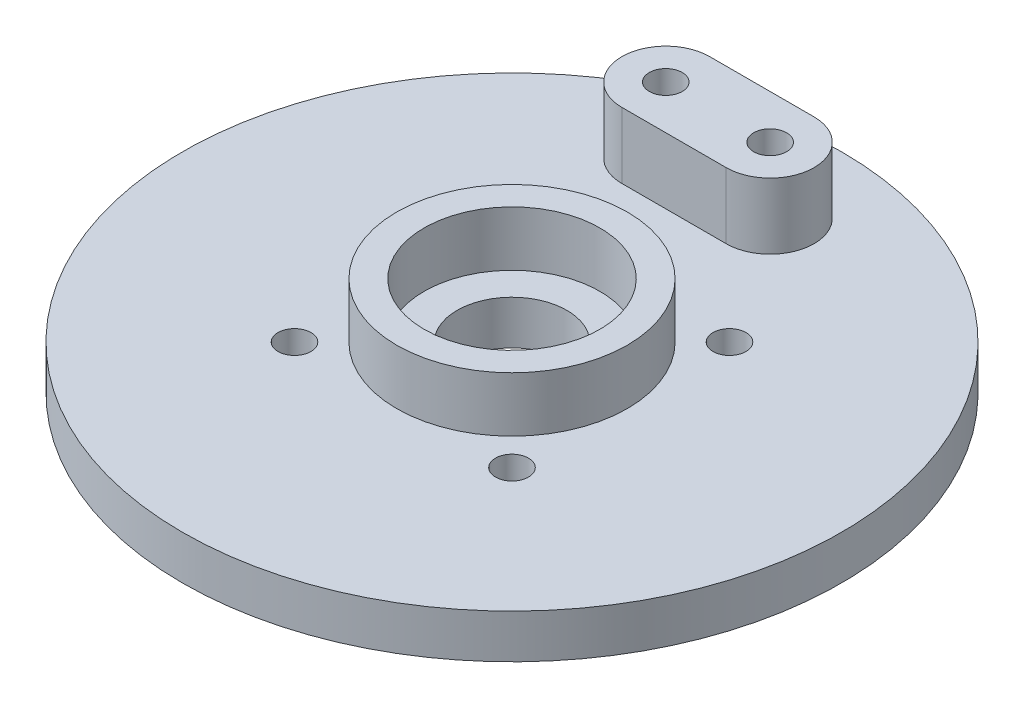
ISO-10303-21;
HEADER;
FILE_DESCRIPTION(('STEP AP214'),'2;1');
FILE_NAME('part.step','',(''),(''),'','','');
FILE_SCHEMA(('AUTOMOTIVE_DESIGN { 1 0 10303 214 1 1 1 1 }'));
ENDSEC;
DATA;
#1=APPLICATION_CONTEXT('core data for automotive mechanical design processes');
#2=APPLICATION_PROTOCOL_DEFINITION('international standard','automotive_design',2000,#1);
#3=PRODUCT_CONTEXT('',#1,'mechanical');
#4=PRODUCT('Part','Part','',(#3));
#5=PRODUCT_RELATED_PRODUCT_CATEGORY('part','',(#4));
#6=PRODUCT_DEFINITION_FORMATION('','',#4);
#7=PRODUCT_DEFINITION_CONTEXT('part definition',#1,'design');
#8=PRODUCT_DEFINITION('design','',#6,#7);
#9=PRODUCT_DEFINITION_SHAPE('','',#8);
#10=(LENGTH_UNIT() NAMED_UNIT(*) SI_UNIT(.MILLI.,.METRE.));
#11=(NAMED_UNIT(*) PLANE_ANGLE_UNIT() SI_UNIT($,.RADIAN.));
#12=(NAMED_UNIT(*) SI_UNIT($,.STERADIAN.) SOLID_ANGLE_UNIT());
#13=UNCERTAINTY_MEASURE_WITH_UNIT(LENGTH_MEASURE(1.E-05),#10,'distance_accuracy_value','');
#14=(GEOMETRIC_REPRESENTATION_CONTEXT(3) GLOBAL_UNCERTAINTY_ASSIGNED_CONTEXT((#13)) GLOBAL_UNIT_ASSIGNED_CONTEXT((#10,
#11,#12)) REPRESENTATION_CONTEXT('',''));
#15=CARTESIAN_POINT('',(0.,0.,0.));
#16=DIRECTION('',(0.,0.,1.));
#17=DIRECTION('',(1.,0.,0.));
#18=AXIS2_PLACEMENT_3D('',#15,#16,#17);
#19=CARTESIAN_POINT('',(0.,4.,0.));
#20=DIRECTION('',(0.,1.,0.));
#21=DIRECTION('',(0.,0.,1.));
#22=AXIS2_PLACEMENT_3D('',#19,#20,#21);
#23=PLANE('',#22);
#24=CARTESIAN_POINT('',(-9.89949493661168,4.,9.89949493661165));
#25=DIRECTION('',(0.,1.,0.));
#26=DIRECTION('',(0.,0.,1.));
#27=AXIS2_PLACEMENT_3D('',#24,#25,#26);
#28=CIRCLE('',#27,1.5);
#29=CARTESIAN_POINT('',(-9.89949493661168,4.,11.3994949366116));
#30=VERTEX_POINT('',#29);
#31=EDGE_CURVE('E169',#30,#30,#28,.T.);
#32=ORIENTED_EDGE('',*,*,#31,.F.);
#33=EDGE_LOOP('',(#32));
#34=FACE_BOUND('',#33,.T.);
#35=CARTESIAN_POINT('',(9.89949493661165,4.,9.89949493661168));
#36=DIRECTION('',(0.,1.,0.));
#37=DIRECTION('',(0.,0.,1.));
#38=AXIS2_PLACEMENT_3D('',#35,#36,#37);
#39=CIRCLE('',#38,1.5);
#40=CARTESIAN_POINT('',(9.89949493661165,4.,11.3994949366117));
#41=VERTEX_POINT('',#40);
#42=EDGE_CURVE('E173',#41,#41,#39,.T.);
#43=ORIENTED_EDGE('',*,*,#42,.F.);
#44=EDGE_LOOP('',(#43));
#45=FACE_BOUND('',#44,.T.);
#46=CARTESIAN_POINT('',(9.89949493661168,4.,-9.89949493661165));
#47=DIRECTION('',(0.,1.,0.));
#48=DIRECTION('',(0.,0.,1.));
#49=AXIS2_PLACEMENT_3D('',#46,#47,#48);
#50=CIRCLE('',#49,1.5);
#51=CARTESIAN_POINT('',(9.89949493661168,4.,-8.39949493661165));
#52=VERTEX_POINT('',#51);
#53=EDGE_CURVE('E177',#52,#52,#50,.T.);
#54=ORIENTED_EDGE('',*,*,#53,.F.);
#55=EDGE_LOOP('',(#54));
#56=FACE_BOUND('',#55,.T.);
#57=CARTESIAN_POINT('',(-9.89949493661165,4.,-9.89949493661168));
#58=DIRECTION('',(0.,1.,0.));
#59=DIRECTION('',(0.,0.,1.));
#60=AXIS2_PLACEMENT_3D('',#57,#58,#59);
#61=CIRCLE('',#60,1.5);
#62=CARTESIAN_POINT('',(-9.89949493661165,4.,-8.39949493661168));
#63=VERTEX_POINT('',#62);
#64=EDGE_CURVE('E181',#63,#63,#61,.T.);
#65=ORIENTED_EDGE('',*,*,#64,.F.);
#66=EDGE_LOOP('',(#65));
#67=FACE_BOUND('',#66,.T.);
#68=CARTESIAN_POINT('',(0.,4.,0.));
#69=DIRECTION('',(0.,1.,0.));
#70=DIRECTION('',(0.,0.,1.));
#71=AXIS2_PLACEMENT_3D('',#68,#69,#70);
#72=CIRCLE('',#71,30.);
#73=CARTESIAN_POINT('',(0.,4.,30.));
#74=VERTEX_POINT('',#73);
#75=EDGE_CURVE('E40',#74,#74,#72,.T.);
#76=ORIENTED_EDGE('',*,*,#75,.T.);
#77=EDGE_LOOP('',(#76));
#78=FACE_BOUND('',#77,.T.);
#79=CARTESIAN_POINT('',(0.,4.,0.));
#80=DIRECTION('',(0.,1.,0.));
#81=DIRECTION('',(0.,0.,1.));
#82=AXIS2_PLACEMENT_3D('',#79,#80,#81);
#83=CIRCLE('',#82,10.5);
#84=CARTESIAN_POINT('',(0.,4.,10.5));
#85=VERTEX_POINT('',#84);
#86=EDGE_CURVE('E120',#85,#85,#83,.T.);
#87=ORIENTED_EDGE('',*,*,#86,.F.);
#88=EDGE_LOOP('',(#87));
#89=FACE_BOUND('',#88,.T.);
#90=DIRECTION('',(-1.,0.,0.));
#91=VECTOR('',#90,1.);
#92=CARTESIAN_POINT('',(2.,4.,-25.5));
#93=LINE('',#92,#91);
#94=CARTESIAN_POINT('',(2.,4.,-25.5));
#95=VERTEX_POINT('',#94);
#96=CARTESIAN_POINT('',(-7.5,4.,-25.5));
#97=VERTEX_POINT('',#96);
#98=EDGE_CURVE('E89',#95,#97,#93,.T.);
#99=ORIENTED_EDGE('',*,*,#98,.F.);
#100=CARTESIAN_POINT('',(2.,4.,-21.5));
#101=DIRECTION('',(0.,1.,0.));
#102=DIRECTION('',(0.,0.,1.));
#103=AXIS2_PLACEMENT_3D('',#100,#101,#102);
#104=CIRCLE('',#103,4.);
#105=CARTESIAN_POINT('',(2.,4.,-17.5));
#106=VERTEX_POINT('',#105);
#107=EDGE_CURVE('E100',#106,#95,#104,.T.);
#108=ORIENTED_EDGE('',*,*,#107,.F.);
#109=DIRECTION('',(1.,0.,0.));
#110=VECTOR('',#109,1.);
#111=CARTESIAN_POINT('',(-7.5,4.,-17.5));
#112=LINE('',#111,#110);
#113=CARTESIAN_POINT('',(-7.5,4.,-17.5));
#114=VERTEX_POINT('',#113);
#115=EDGE_CURVE('E69',#114,#106,#112,.T.);
#116=ORIENTED_EDGE('',*,*,#115,.F.);
#117=CARTESIAN_POINT('',(-7.5,4.,-21.5));
#118=DIRECTION('',(0.,1.,0.));
#119=DIRECTION('',(0.,0.,1.));
#120=AXIS2_PLACEMENT_3D('',#117,#118,#119);
#121=CIRCLE('',#120,4.);
#122=EDGE_CURVE('E105',#97,#114,#121,.T.);
#123=ORIENTED_EDGE('',*,*,#122,.F.);
#124=EDGE_LOOP('',(#99,#108,#116,#123));
#125=FACE_BOUND('',#124,.T.);
#126=ADVANCED_FACE('F32',(#34,#45,#56,#67,#78,#89,#125),#23,.T.);
#127=CARTESIAN_POINT('',(0.,4.,0.));
#128=DIRECTION('',(0.,1.,0.));
#129=DIRECTION('',(0.,0.,1.));
#130=AXIS2_PLACEMENT_3D('',#127,#128,#129);
#131=CIRCLE('',#130,5.);
#132=CARTESIAN_POINT('',(0.,4.,5.));
#133=VERTEX_POINT('',#132);
#134=EDGE_CURVE('E127',#133,#133,#131,.T.);
#135=ORIENTED_EDGE('',*,*,#134,.F.);
#136=EDGE_LOOP('',(#135));
#137=FACE_BOUND('',#136,.T.);
#138=CARTESIAN_POINT('',(0.,4.,0.));
#139=DIRECTION('',(0.,1.,0.));
#140=DIRECTION('',(0.,0.,1.));
#141=AXIS2_PLACEMENT_3D('',#138,#139,#140);
#142=CIRCLE('',#141,8.);
#143=CARTESIAN_POINT('',(0.,4.,8.));
#144=VERTEX_POINT('',#143);
#145=EDGE_CURVE('E11',#144,#144,#142,.F.);
#146=ORIENTED_EDGE('',*,*,#145,.F.);
#147=EDGE_LOOP('',(#146));
#148=FACE_BOUND('',#147,.T.);
#149=ADVANCED_FACE('F141',(#137,#148),#23,.T.);
#150=CARTESIAN_POINT('',(0.,0.,0.));
#151=DIRECTION('',(0.,1.,0.));
#152=DIRECTION('',(0.,0.,1.));
#153=AXIS2_PLACEMENT_3D('',#150,#151,#152);
#154=PLANE('',#153);
#155=CARTESIAN_POINT('',(-9.89949493661168,0.,9.89949493661165));
#156=DIRECTION('',(0.,1.,0.));
#157=DIRECTION('',(0.,0.,1.));
#158=AXIS2_PLACEMENT_3D('',#155,#156,#157);
#159=CIRCLE('',#158,1.5);
#160=CARTESIAN_POINT('',(-9.89949493661168,0.,11.3994949366116));
#161=VERTEX_POINT('',#160);
#162=EDGE_CURVE('E319',#161,#161,#159,.T.);
#163=ORIENTED_EDGE('',*,*,#162,.T.);
#164=EDGE_LOOP('',(#163));
#165=FACE_BOUND('',#164,.T.);
#166=CARTESIAN_POINT('',(9.89949493661165,0.,9.89949493661168));
#167=DIRECTION('',(0.,1.,0.));
#168=DIRECTION('',(0.,0.,1.));
#169=AXIS2_PLACEMENT_3D('',#166,#167,#168);
#170=CIRCLE('',#169,1.5);
#171=CARTESIAN_POINT('',(9.89949493661165,0.,11.3994949366117));
#172=VERTEX_POINT('',#171);
#173=EDGE_CURVE('E342',#172,#172,#170,.T.);
#174=ORIENTED_EDGE('',*,*,#173,.T.);
#175=EDGE_LOOP('',(#174));
#176=FACE_BOUND('',#175,.T.);
#177=CARTESIAN_POINT('',(9.89949493661168,0.,-9.89949493661165));
#178=DIRECTION('',(0.,1.,0.));
#179=DIRECTION('',(0.,0.,1.));
#180=AXIS2_PLACEMENT_3D('',#177,#178,#179);
#181=CIRCLE('',#180,1.5);
#182=CARTESIAN_POINT('',(9.89949493661168,0.,-8.39949493661165));
#183=VERTEX_POINT('',#182);
#184=EDGE_CURVE('E329',#183,#183,#181,.T.);
#185=ORIENTED_EDGE('',*,*,#184,.T.);
#186=EDGE_LOOP('',(#185));
#187=FACE_BOUND('',#186,.T.);
#188=CARTESIAN_POINT('',(-9.89949493661165,0.,-9.89949493661168));
#189=DIRECTION('',(0.,1.,0.));
#190=DIRECTION('',(0.,0.,1.));
#191=AXIS2_PLACEMENT_3D('',#188,#189,#190);
#192=CIRCLE('',#191,1.5);
#193=CARTESIAN_POINT('',(-9.89949493661165,0.,-8.39949493661168));
#194=VERTEX_POINT('',#193);
#195=EDGE_CURVE('E324',#194,#194,#192,.T.);
#196=ORIENTED_EDGE('',*,*,#195,.T.);
#197=EDGE_LOOP('',(#196));
#198=FACE_BOUND('',#197,.T.);
#199=CARTESIAN_POINT('',(-7.5,0.,-21.5));
#200=DIRECTION('',(0.,1.,0.));
#201=DIRECTION('',(0.,0.,1.));
#202=AXIS2_PLACEMENT_3D('',#199,#200,#201);
#203=CIRCLE('',#202,1.5);
#204=CARTESIAN_POINT('',(-7.5,0.,-20.));
#205=VERTEX_POINT('',#204);
#206=EDGE_CURVE('E112',#205,#205,#203,.T.);
#207=ORIENTED_EDGE('',*,*,#206,.T.);
#208=EDGE_LOOP('',(#207));
#209=FACE_BOUND('',#208,.T.);
#210=CARTESIAN_POINT('',(2.,0.,-21.5));
#211=DIRECTION('',(0.,1.,0.));
#212=DIRECTION('',(0.,0.,1.));
#213=AXIS2_PLACEMENT_3D('',#210,#211,#212);
#214=CIRCLE('',#213,1.5);
#215=CARTESIAN_POINT('',(2.,0.,-20.));
#216=VERTEX_POINT('',#215);
#217=EDGE_CURVE('E111',#216,#216,#214,.T.);
#218=ORIENTED_EDGE('',*,*,#217,.T.);
#219=EDGE_LOOP('',(#218));
#220=FACE_BOUND('',#219,.T.);
#221=CARTESIAN_POINT('',(0.,0.,0.));
#222=DIRECTION('',(0.,1.,0.));
#223=DIRECTION('',(0.,0.,1.));
#224=AXIS2_PLACEMENT_3D('',#221,#222,#223);
#225=CIRCLE('',#224,30.);
#226=CARTESIAN_POINT('',(0.,0.,30.));
#227=VERTEX_POINT('',#226);
#228=EDGE_CURVE('E130',#227,#227,#225,.T.);
#229=ORIENTED_EDGE('',*,*,#228,.F.);
#230=EDGE_LOOP('',(#229));
#231=FACE_BOUND('',#230,.T.);
#232=CARTESIAN_POINT('',(0.,0.,0.));
#233=DIRECTION('',(0.,1.,0.));
#234=DIRECTION('',(0.,0.,1.));
#235=AXIS2_PLACEMENT_3D('',#232,#233,#234);
#236=CIRCLE('',#235,5.);
#237=CARTESIAN_POINT('',(0.,0.,5.));
#238=VERTEX_POINT('',#237);
#239=EDGE_CURVE('E124',#238,#238,#236,.T.);
#240=ORIENTED_EDGE('',*,*,#239,.T.);
#241=EDGE_LOOP('',(#240));
#242=FACE_BOUND('',#241,.T.);
#243=ADVANCED_FACE('F138',(#165,#176,#187,#198,#209,#220,#231,#242),#154,.F.);
#244=CARTESIAN_POINT('',(0.,4.,0.));
#245=DIRECTION('',(0.,-1.,0.));
#246=DIRECTION('',(0.,0.,-1.));
#247=AXIS2_PLACEMENT_3D('',#244,#245,#246);
#248=CYLINDRICAL_SURFACE('',#247,30.);
#249=ORIENTED_EDGE('',*,*,#75,.F.);
#250=EDGE_LOOP('',(#249));
#251=FACE_BOUND('',#250,.T.);
#252=ORIENTED_EDGE('',*,*,#228,.T.);
#253=EDGE_LOOP('',(#252));
#254=FACE_BOUND('',#253,.T.);
#255=ADVANCED_FACE('F34',(#251,#254),#248,.T.);
#256=CARTESIAN_POINT('',(0.,4.,0.));
#257=DIRECTION('',(0.,-1.,0.));
#258=DIRECTION('',(0.,0.,-1.));
#259=AXIS2_PLACEMENT_3D('',#256,#257,#258);
#260=CYLINDRICAL_SURFACE('',#259,5.);
#261=ORIENTED_EDGE('',*,*,#134,.T.);
#262=EDGE_LOOP('',(#261));
#263=FACE_BOUND('',#262,.T.);
#264=ORIENTED_EDGE('',*,*,#239,.F.);
#265=EDGE_LOOP('',(#264));
#266=FACE_BOUND('',#265,.T.);
#267=ADVANCED_FACE('F145',(#263,#266),#260,.F.);
#268=CARTESIAN_POINT('',(0.,9.,0.));
#269=DIRECTION('',(0.,1.,0.));
#270=DIRECTION('',(0.,0.,1.));
#271=AXIS2_PLACEMENT_3D('',#268,#269,#270);
#272=PLANE('',#271);
#273=CARTESIAN_POINT('',(0.,9.,0.));
#274=DIRECTION('',(0.,1.,0.));
#275=DIRECTION('',(0.,0.,1.));
#276=AXIS2_PLACEMENT_3D('',#273,#274,#275);
#277=CIRCLE('',#276,10.5);
#278=CARTESIAN_POINT('',(0.,9.,10.5));
#279=VERTEX_POINT('',#278);
#280=EDGE_CURVE('E121',#279,#279,#277,.T.);
#281=ORIENTED_EDGE('',*,*,#280,.T.);
#282=EDGE_LOOP('',(#281));
#283=FACE_BOUND('',#282,.T.);
#284=CARTESIAN_POINT('',(0.,9.,0.));
#285=DIRECTION('',(0.,1.,0.));
#286=DIRECTION('',(0.,0.,1.));
#287=AXIS2_PLACEMENT_3D('',#284,#285,#286);
#288=CIRCLE('',#287,8.);
#289=CARTESIAN_POINT('',(0.,9.,8.));
#290=VERTEX_POINT('',#289);
#291=EDGE_CURVE('E115',#290,#290,#288,.T.);
#292=ORIENTED_EDGE('',*,*,#291,.F.);
#293=EDGE_LOOP('',(#292));
#294=FACE_BOUND('',#293,.T.);
#295=ADVANCED_FACE('F147',(#283,#294),#272,.T.);
#296=CARTESIAN_POINT('',(0.,9.,0.));
#297=DIRECTION('',(0.,-1.,0.));
#298=DIRECTION('',(0.,0.,-1.));
#299=AXIS2_PLACEMENT_3D('',#296,#297,#298);
#300=CYLINDRICAL_SURFACE('',#299,10.5);
#301=ORIENTED_EDGE('',*,*,#280,.F.);
#302=EDGE_LOOP('',(#301));
#303=FACE_BOUND('',#302,.T.);
#304=ORIENTED_EDGE('',*,*,#86,.T.);
#305=EDGE_LOOP('',(#304));
#306=FACE_BOUND('',#305,.T.);
#307=ADVANCED_FACE('F154',(#303,#306),#300,.T.);
#308=CARTESIAN_POINT('',(0.,9.,0.));
#309=DIRECTION('',(0.,-1.,0.));
#310=DIRECTION('',(0.,0.,-1.));
#311=AXIS2_PLACEMENT_3D('',#308,#309,#310);
#312=CYLINDRICAL_SURFACE('',#311,8.);
#313=ORIENTED_EDGE('',*,*,#291,.T.);
#314=EDGE_LOOP('',(#313));
#315=FACE_BOUND('',#314,.T.);
#316=ORIENTED_EDGE('',*,*,#145,.T.);
#317=EDGE_LOOP('',(#316));
#318=FACE_BOUND('',#317,.T.);
#319=ADVANCED_FACE('F214',(#315,#318),#312,.F.);
#320=CARTESIAN_POINT('',(2.,0.,-21.5));
#321=DIRECTION('',(0.,1.,0.));
#322=DIRECTION('',(0.,0.,1.));
#323=AXIS2_PLACEMENT_3D('',#320,#321,#322);
#324=CYLINDRICAL_SURFACE('',#323,1.5);
#325=ORIENTED_EDGE('',*,*,#217,.F.);
#326=EDGE_LOOP('',(#325));
#327=FACE_BOUND('',#326,.T.);
#328=CARTESIAN_POINT('',(2.,10.,-21.5));
#329=DIRECTION('',(0.,1.,0.));
#330=DIRECTION('',(0.,0.,1.));
#331=AXIS2_PLACEMENT_3D('',#328,#329,#330);
#332=CIRCLE('',#331,1.5);
#333=CARTESIAN_POINT('',(2.,10.,-20.));
#334=VERTEX_POINT('',#333);
#335=EDGE_CURVE('E327',#334,#334,#332,.T.);
#336=ORIENTED_EDGE('',*,*,#335,.T.);
#337=EDGE_LOOP('',(#336));
#338=FACE_BOUND('',#337,.T.);
#339=ADVANCED_FACE('F210',(#327,#338),#324,.F.);
#340=CARTESIAN_POINT('',(-7.5,0.,-21.5));
#341=DIRECTION('',(0.,1.,0.));
#342=DIRECTION('',(0.,0.,1.));
#343=AXIS2_PLACEMENT_3D('',#340,#341,#342);
#344=CYLINDRICAL_SURFACE('',#343,1.5);
#345=ORIENTED_EDGE('',*,*,#206,.F.);
#346=EDGE_LOOP('',(#345));
#347=FACE_BOUND('',#346,.T.);
#348=CARTESIAN_POINT('',(-7.5,10.,-21.5));
#349=DIRECTION('',(0.,1.,0.));
#350=DIRECTION('',(0.,0.,1.));
#351=AXIS2_PLACEMENT_3D('',#348,#349,#350);
#352=CIRCLE('',#351,1.5);
#353=CARTESIAN_POINT('',(-7.5,10.,-20.));
#354=VERTEX_POINT('',#353);
#355=EDGE_CURVE('E103',#354,#354,#352,.T.);
#356=ORIENTED_EDGE('',*,*,#355,.T.);
#357=EDGE_LOOP('',(#356));
#358=FACE_BOUND('',#357,.T.);
#359=ADVANCED_FACE('F207',(#347,#358),#344,.F.);
#360=CARTESIAN_POINT('',(2.,10.,-21.5));
#361=DIRECTION('',(0.,1.,0.));
#362=DIRECTION('',(0.,0.,1.));
#363=AXIS2_PLACEMENT_3D('',#360,#361,#362);
#364=PLANE('',#363);
#365=ORIENTED_EDGE('',*,*,#355,.F.);
#366=EDGE_LOOP('',(#365));
#367=FACE_BOUND('',#366,.T.);
#368=CARTESIAN_POINT('',(2.,10.,-21.5));
#369=DIRECTION('',(0.,1.,0.));
#370=DIRECTION('',(0.,0.,1.));
#371=AXIS2_PLACEMENT_3D('',#368,#369,#370);
#372=CIRCLE('',#371,4.);
#373=CARTESIAN_POINT('',(2.,10.,-17.5));
#374=VERTEX_POINT('',#373);
#375=CARTESIAN_POINT('',(2.,10.,-25.5));
#376=VERTEX_POINT('',#375);
#377=EDGE_CURVE('E82',#374,#376,#372,.T.);
#378=ORIENTED_EDGE('',*,*,#377,.T.);
#379=DIRECTION('',(-1.,0.,0.));
#380=VECTOR('',#379,1.);
#381=CARTESIAN_POINT('',(2.,10.,-25.5));
#382=LINE('',#381,#380);
#383=CARTESIAN_POINT('',(-7.5,10.,-25.5));
#384=VERTEX_POINT('',#383);
#385=EDGE_CURVE('E76',#376,#384,#382,.T.);
#386=ORIENTED_EDGE('',*,*,#385,.T.);
#387=CARTESIAN_POINT('',(-7.5,10.,-21.5));
#388=DIRECTION('',(0.,1.,0.));
#389=DIRECTION('',(0.,0.,1.));
#390=AXIS2_PLACEMENT_3D('',#387,#388,#389);
#391=CIRCLE('',#390,4.);
#392=CARTESIAN_POINT('',(-7.5,10.,-17.5));
#393=VERTEX_POINT('',#392);
#394=EDGE_CURVE('E80',#384,#393,#391,.T.);
#395=ORIENTED_EDGE('',*,*,#394,.T.);
#396=DIRECTION('',(1.,0.,0.));
#397=VECTOR('',#396,1.);
#398=CARTESIAN_POINT('',(-7.5,10.,-17.5));
#399=LINE('',#398,#397);
#400=EDGE_CURVE('E55',#393,#374,#399,.T.);
#401=ORIENTED_EDGE('',*,*,#400,.T.);
#402=EDGE_LOOP('',(#378,#386,#395,#401));
#403=FACE_BOUND('',#402,.T.);
#404=ORIENTED_EDGE('',*,*,#335,.F.);
#405=EDGE_LOOP('',(#404));
#406=FACE_BOUND('',#405,.T.);
#407=ADVANCED_FACE('F77',(#367,#403,#406),#364,.T.);
#408=CARTESIAN_POINT('',(2.,10.,-21.5));
#409=DIRECTION('',(0.,-1.,0.));
#410=DIRECTION('',(0.,0.,-1.));
#411=AXIS2_PLACEMENT_3D('',#408,#409,#410);
#412=CYLINDRICAL_SURFACE('',#411,4.);
#413=ORIENTED_EDGE('',*,*,#107,.T.);
#414=DIRECTION('',(0.,-1.,0.));
#415=VECTOR('',#414,1.);
#416=CARTESIAN_POINT('',(2.,10.,-25.5));
#417=LINE('',#416,#415);
#418=EDGE_CURVE('E92',#376,#95,#417,.T.);
#419=ORIENTED_EDGE('',*,*,#418,.F.);
#420=ORIENTED_EDGE('',*,*,#377,.F.);
#421=DIRECTION('',(0.,-1.,0.));
#422=VECTOR('',#421,1.);
#423=CARTESIAN_POINT('',(2.,10.,-17.5));
#424=LINE('',#423,#422);
#425=EDGE_CURVE('E96',#374,#106,#424,.T.);
#426=ORIENTED_EDGE('',*,*,#425,.T.);
#427=EDGE_LOOP('',(#413,#419,#420,#426));
#428=FACE_BOUND('',#427,.T.);
#429=ADVANCED_FACE('F188',(#428),#412,.T.);
#430=CARTESIAN_POINT('',(2.,10.,-25.5));
#431=DIRECTION('',(0.,0.,1.));
#432=DIRECTION('',(1.,0.,0.));
#433=AXIS2_PLACEMENT_3D('',#430,#431,#432);
#434=PLANE('',#433);
#435=ORIENTED_EDGE('',*,*,#98,.T.);
#436=DIRECTION('',(0.,-1.,0.));
#437=VECTOR('',#436,1.);
#438=CARTESIAN_POINT('',(-7.5,10.,-25.5));
#439=LINE('',#438,#437);
#440=EDGE_CURVE('E86',#384,#97,#439,.T.);
#441=ORIENTED_EDGE('',*,*,#440,.F.);
#442=ORIENTED_EDGE('',*,*,#385,.F.);
#443=ORIENTED_EDGE('',*,*,#418,.T.);
#444=EDGE_LOOP('',(#435,#441,#442,#443));
#445=FACE_BOUND('',#444,.T.);
#446=ADVANCED_FACE('F87',(#445),#434,.F.);
#447=CARTESIAN_POINT('',(-7.5,10.,-21.5));
#448=DIRECTION('',(0.,-1.,0.));
#449=DIRECTION('',(0.,0.,-1.));
#450=AXIS2_PLACEMENT_3D('',#447,#448,#449);
#451=CYLINDRICAL_SURFACE('',#450,4.);
#452=ORIENTED_EDGE('',*,*,#122,.T.);
#453=DIRECTION('',(0.,-1.,0.));
#454=VECTOR('',#453,1.);
#455=CARTESIAN_POINT('',(-7.5,10.,-17.5));
#456=LINE('',#455,#454);
#457=EDGE_CURVE('E47',#393,#114,#456,.T.);
#458=ORIENTED_EDGE('',*,*,#457,.F.);
#459=ORIENTED_EDGE('',*,*,#394,.F.);
#460=ORIENTED_EDGE('',*,*,#440,.T.);
#461=EDGE_LOOP('',(#452,#458,#459,#460));
#462=FACE_BOUND('',#461,.T.);
#463=ADVANCED_FACE('F94',(#462),#451,.T.);
#464=CARTESIAN_POINT('',(-7.5,10.,-17.5));
#465=DIRECTION('',(0.,0.,-1.));
#466=DIRECTION('',(-1.,0.,0.));
#467=AXIS2_PLACEMENT_3D('',#464,#465,#466);
#468=PLANE('',#467);
#469=ORIENTED_EDGE('',*,*,#115,.T.);
#470=ORIENTED_EDGE('',*,*,#425,.F.);
#471=ORIENTED_EDGE('',*,*,#400,.F.);
#472=ORIENTED_EDGE('',*,*,#457,.T.);
#473=EDGE_LOOP('',(#469,#470,#471,#472));
#474=FACE_BOUND('',#473,.T.);
#475=ADVANCED_FACE('F189',(#474),#468,.F.);
#476=CARTESIAN_POINT('',(-9.89949493661165,0.,-9.89949493661168));
#477=DIRECTION('',(0.,1.,0.));
#478=DIRECTION('',(0.,0.,1.));
#479=AXIS2_PLACEMENT_3D('',#476,#477,#478);
#480=CYLINDRICAL_SURFACE('',#479,1.5);
#481=ORIENTED_EDGE('',*,*,#195,.F.);
#482=EDGE_LOOP('',(#481));
#483=FACE_BOUND('',#482,.T.);
#484=ORIENTED_EDGE('',*,*,#64,.T.);
#485=EDGE_LOOP('',(#484));
#486=FACE_BOUND('',#485,.T.);
#487=ADVANCED_FACE('F191',(#483,#486),#480,.F.);
#488=CARTESIAN_POINT('',(9.89949493661168,0.,-9.89949493661165));
#489=DIRECTION('',(0.,1.,0.));
#490=DIRECTION('',(0.,0.,1.));
#491=AXIS2_PLACEMENT_3D('',#488,#489,#490);
#492=CYLINDRICAL_SURFACE('',#491,1.5);
#493=ORIENTED_EDGE('',*,*,#184,.F.);
#494=EDGE_LOOP('',(#493));
#495=FACE_BOUND('',#494,.T.);
#496=ORIENTED_EDGE('',*,*,#53,.T.);
#497=EDGE_LOOP('',(#496));
#498=FACE_BOUND('',#497,.T.);
#499=ADVANCED_FACE('F197',(#495,#498),#492,.F.);
#500=CARTESIAN_POINT('',(9.89949493661165,0.,9.89949493661168));
#501=DIRECTION('',(0.,1.,0.));
#502=DIRECTION('',(0.,0.,1.));
#503=AXIS2_PLACEMENT_3D('',#500,#501,#502);
#504=CYLINDRICAL_SURFACE('',#503,1.5);
#505=ORIENTED_EDGE('',*,*,#173,.F.);
#506=EDGE_LOOP('',(#505));
#507=FACE_BOUND('',#506,.T.);
#508=ORIENTED_EDGE('',*,*,#42,.T.);
#509=EDGE_LOOP('',(#508));
#510=FACE_BOUND('',#509,.T.);
#511=ADVANCED_FACE('F292',(#507,#510),#504,.F.);
#512=CARTESIAN_POINT('',(-9.89949493661168,0.,9.89949493661165));
#513=DIRECTION('',(0.,1.,0.));
#514=DIRECTION('',(0.,0.,1.));
#515=AXIS2_PLACEMENT_3D('',#512,#513,#514);
#516=CYLINDRICAL_SURFACE('',#515,1.5);
#517=ORIENTED_EDGE('',*,*,#162,.F.);
#518=EDGE_LOOP('',(#517));
#519=FACE_BOUND('',#518,.T.);
#520=ORIENTED_EDGE('',*,*,#31,.T.);
#521=EDGE_LOOP('',(#520));
#522=FACE_BOUND('',#521,.T.);
#523=ADVANCED_FACE('F302',(#519,#522),#516,.F.);
#524=CLOSED_SHELL('',(#126,#149,#243,#255,#267,#295,#307,#319,#339,#359,#407,#429,#446,#463,
#475,#487,#499,#511,#523));
#525=MANIFOLD_SOLID_BREP('B2',#524);
#526=ADVANCED_BREP_SHAPE_REPRESENTATION('',(#18,#525),#14);
#527=SHAPE_DEFINITION_REPRESENTATION(#9,#526);
ENDSEC;
END-ISO-10303-21;
